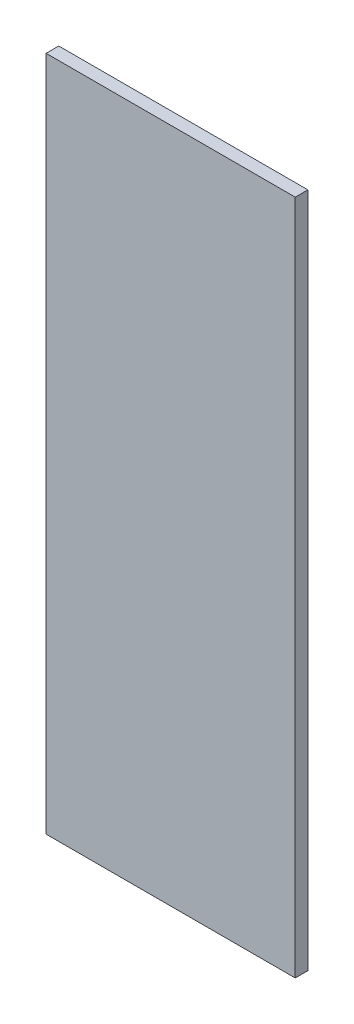
ISO-10303-21;
HEADER;
FILE_DESCRIPTION(('STEP AP214'),'2;1');
FILE_NAME('part.step','',(''),(''),'','','');
FILE_SCHEMA(('AUTOMOTIVE_DESIGN { 1 0 10303 214 1 1 1 1 }'));
ENDSEC;
DATA;
#1=APPLICATION_CONTEXT('core data for automotive mechanical design processes');
#2=APPLICATION_PROTOCOL_DEFINITION('international standard','automotive_design',2000,#1);
#3=PRODUCT_CONTEXT('',#1,'mechanical');
#4=PRODUCT('Part','Part','',(#3));
#5=PRODUCT_RELATED_PRODUCT_CATEGORY('part','',(#4));
#6=PRODUCT_DEFINITION_FORMATION('','',#4);
#7=PRODUCT_DEFINITION_CONTEXT('part definition',#1,'design');
#8=PRODUCT_DEFINITION('design','',#6,#7);
#9=PRODUCT_DEFINITION_SHAPE('','',#8);
#10=(LENGTH_UNIT() NAMED_UNIT(*) SI_UNIT(.MILLI.,.METRE.));
#11=(NAMED_UNIT(*) PLANE_ANGLE_UNIT() SI_UNIT($,.RADIAN.));
#12=(NAMED_UNIT(*) SI_UNIT($,.STERADIAN.) SOLID_ANGLE_UNIT());
#13=UNCERTAINTY_MEASURE_WITH_UNIT(LENGTH_MEASURE(1.E-05),#10,'distance_accuracy_value','');
#14=(GEOMETRIC_REPRESENTATION_CONTEXT(3) GLOBAL_UNCERTAINTY_ASSIGNED_CONTEXT((#13)) GLOBAL_UNIT_ASSIGNED_CONTEXT((#10,
#11,#12)) REPRESENTATION_CONTEXT('',''));
#15=CARTESIAN_POINT('',(0.,0.,0.));
#16=DIRECTION('',(0.,0.,1.));
#17=DIRECTION('',(1.,0.,0.));
#18=AXIS2_PLACEMENT_3D('',#15,#16,#17);
#19=CARTESIAN_POINT('',(90.4420013427734,76.5279998779297,0.));
#20=DIRECTION('',(1.,0.,0.));
#21=DIRECTION('',(0.,-1.,0.));
#22=AXIS2_PLACEMENT_3D('',#19,#20,#21);
#23=PLANE('',#22);
#24=DIRECTION('',(0.,-1.,0.));
#25=VECTOR('',#24,1.);
#26=CARTESIAN_POINT('',(90.4420013427734,76.5279998779297,0.03556));
#27=LINE('',#26,#25);
#28=CARTESIAN_POINT('',(90.4420013427734,76.5279998779297,0.03556));
#29=VERTEX_POINT('',#28);
#30=CARTESIAN_POINT('',(90.4420013427734,74.6279983520508,0.03556));
#31=VERTEX_POINT('',#30);
#32=EDGE_CURVE('E11',#29,#31,#27,.T.);
#33=ORIENTED_EDGE('',*,*,#32,.F.);
#34=DIRECTION('',(0.,0.,1.));
#35=VECTOR('',#34,1.);
#36=CARTESIAN_POINT('',(90.4420013427734,76.5279998779297,0.));
#37=LINE('',#36,#35);
#38=CARTESIAN_POINT('',(90.4420013427734,76.5279998779297,0.));
#39=VERTEX_POINT('',#38);
#40=EDGE_CURVE('E24',#39,#29,#37,.T.);
#41=ORIENTED_EDGE('',*,*,#40,.F.);
#42=DIRECTION('',(0.,-1.,0.));
#43=VECTOR('',#42,1.);
#44=CARTESIAN_POINT('',(90.4420013427734,76.5279998779297,0.));
#45=LINE('',#44,#43);
#46=CARTESIAN_POINT('',(90.4420013427734,74.6279983520508,0.));
#47=VERTEX_POINT('',#46);
#48=EDGE_CURVE('E75',#39,#47,#45,.T.);
#49=ORIENTED_EDGE('',*,*,#48,.T.);
#50=DIRECTION('',(0.,0.,1.));
#51=VECTOR('',#50,1.);
#52=CARTESIAN_POINT('',(90.4420013427734,74.6279983520508,0.));
#53=LINE('',#52,#51);
#54=EDGE_CURVE('E37',#47,#31,#53,.T.);
#55=ORIENTED_EDGE('',*,*,#54,.T.);
#56=EDGE_LOOP('',(#33,#41,#49,#55));
#57=FACE_BOUND('',#56,.T.);
#58=ADVANCED_FACE('F17',(#57),#23,.F.);
#59=CARTESIAN_POINT('',(90.4420013427734,74.6279983520508,0.));
#60=DIRECTION('',(0.,1.,0.));
#61=DIRECTION('',(1.,0.,0.));
#62=AXIS2_PLACEMENT_3D('',#59,#60,#61);
#63=PLANE('',#62);
#64=DIRECTION('',(1.,0.,0.));
#65=VECTOR('',#64,1.);
#66=CARTESIAN_POINT('',(90.4420013427734,74.6279983520508,0.03556));
#67=LINE('',#66,#65);
#68=CARTESIAN_POINT('',(91.1419982910156,74.6279983520508,0.03556));
#69=VERTEX_POINT('',#68);
#70=EDGE_CURVE('E83',#31,#69,#67,.T.);
#71=ORIENTED_EDGE('',*,*,#70,.F.);
#72=ORIENTED_EDGE('',*,*,#54,.F.);
#73=DIRECTION('',(1.,0.,0.));
#74=VECTOR('',#73,1.);
#75=CARTESIAN_POINT('',(90.4420013427734,74.6279983520508,0.));
#76=LINE('',#75,#74);
#77=CARTESIAN_POINT('',(91.1419982910156,74.6279983520508,0.));
#78=VERTEX_POINT('',#77);
#79=EDGE_CURVE('E81',#47,#78,#76,.T.);
#80=ORIENTED_EDGE('',*,*,#79,.T.);
#81=DIRECTION('',(0.,0.,1.));
#82=VECTOR('',#81,1.);
#83=CARTESIAN_POINT('',(91.1419982910156,74.6279983520508,0.));
#84=LINE('',#83,#82);
#85=EDGE_CURVE('E67',#78,#69,#84,.T.);
#86=ORIENTED_EDGE('',*,*,#85,.T.);
#87=EDGE_LOOP('',(#71,#72,#80,#86));
#88=FACE_BOUND('',#87,.T.);
#89=ADVANCED_FACE('F89',(#88),#63,.F.);
#90=CARTESIAN_POINT('',(91.1419982910156,74.6279983520508,0.));
#91=DIRECTION('',(-1.,0.,0.));
#92=DIRECTION('',(0.,1.,0.));
#93=AXIS2_PLACEMENT_3D('',#90,#91,#92);
#94=PLANE('',#93);
#95=DIRECTION('',(0.,1.,0.));
#96=VECTOR('',#95,1.);
#97=CARTESIAN_POINT('',(91.1419982910156,74.6279983520508,0.03556));
#98=LINE('',#97,#96);
#99=CARTESIAN_POINT('',(91.1419982910156,76.5279998779297,0.03556));
#100=VERTEX_POINT('',#99);
#101=EDGE_CURVE('E71',#69,#100,#98,.T.);
#102=ORIENTED_EDGE('',*,*,#101,.F.);
#103=ORIENTED_EDGE('',*,*,#85,.F.);
#104=DIRECTION('',(0.,1.,0.));
#105=VECTOR('',#104,1.);
#106=CARTESIAN_POINT('',(91.1419982910156,74.6279983520508,0.));
#107=LINE('',#106,#105);
#108=CARTESIAN_POINT('',(91.1419982910156,76.5279998779297,0.));
#109=VERTEX_POINT('',#108);
#110=EDGE_CURVE('E63',#78,#109,#107,.T.);
#111=ORIENTED_EDGE('',*,*,#110,.T.);
#112=DIRECTION('',(0.,0.,1.));
#113=VECTOR('',#112,1.);
#114=CARTESIAN_POINT('',(91.1419982910156,76.5279998779297,0.));
#115=LINE('',#114,#113);
#116=EDGE_CURVE('E53',#109,#100,#115,.T.);
#117=ORIENTED_EDGE('',*,*,#116,.T.);
#118=EDGE_LOOP('',(#102,#103,#111,#117));
#119=FACE_BOUND('',#118,.T.);
#120=ADVANCED_FACE('F66',(#119),#94,.F.);
#121=CARTESIAN_POINT('',(91.1419982910156,76.5279998779297,0.));
#122=DIRECTION('',(0.,-1.,0.));
#123=DIRECTION('',(-1.,0.,0.));
#124=AXIS2_PLACEMENT_3D('',#121,#122,#123);
#125=PLANE('',#124);
#126=DIRECTION('',(-1.,0.,0.));
#127=VECTOR('',#126,1.);
#128=CARTESIAN_POINT('',(91.1419982910156,76.5279998779297,0.03556));
#129=LINE('',#128,#127);
#130=EDGE_CURVE('E59',#100,#29,#129,.T.);
#131=ORIENTED_EDGE('',*,*,#130,.F.);
#132=ORIENTED_EDGE('',*,*,#116,.F.);
#133=DIRECTION('',(-1.,0.,0.));
#134=VECTOR('',#133,1.);
#135=CARTESIAN_POINT('',(91.1419982910156,76.5279998779297,0.));
#136=LINE('',#135,#134);
#137=EDGE_CURVE('E57',#109,#39,#136,.T.);
#138=ORIENTED_EDGE('',*,*,#137,.T.);
#139=ORIENTED_EDGE('',*,*,#40,.T.);
#140=EDGE_LOOP('',(#131,#132,#138,#139));
#141=FACE_BOUND('',#140,.T.);
#142=ADVANCED_FACE('F55',(#141),#125,.F.);
#143=CARTESIAN_POINT('',(90.4420013427734,76.5279998779297,0.));
#144=DIRECTION('',(0.,0.,-1.));
#145=DIRECTION('',(-1.,0.,0.));
#146=AXIS2_PLACEMENT_3D('',#143,#144,#145);
#147=PLANE('',#146);
#148=ORIENTED_EDGE('',*,*,#137,.F.);
#149=ORIENTED_EDGE('',*,*,#110,.F.);
#150=ORIENTED_EDGE('',*,*,#79,.F.);
#151=ORIENTED_EDGE('',*,*,#48,.F.);
#152=EDGE_LOOP('',(#148,#149,#150,#151));
#153=FACE_BOUND('',#152,.T.);
#154=ADVANCED_FACE('F74',(#153),#147,.T.);
#155=CARTESIAN_POINT('',(90.4420013427734,76.5279998779297,0.03556));
#156=DIRECTION('',(0.,0.,-1.));
#157=DIRECTION('',(-1.,0.,0.));
#158=AXIS2_PLACEMENT_3D('',#155,#156,#157);
#159=PLANE('',#158);
#160=ORIENTED_EDGE('',*,*,#32,.T.);
#161=ORIENTED_EDGE('',*,*,#70,.T.);
#162=ORIENTED_EDGE('',*,*,#101,.T.);
#163=ORIENTED_EDGE('',*,*,#130,.T.);
#164=EDGE_LOOP('',(#160,#161,#162,#163));
#165=FACE_BOUND('',#164,.T.);
#166=ADVANCED_FACE('F91',(#165),#159,.F.);
#167=CLOSED_SHELL('',(#58,#89,#120,#142,#154,#166));
#168=MANIFOLD_SOLID_BREP('B1',#167);
#169=ADVANCED_BREP_SHAPE_REPRESENTATION('',(#18,#168),#14);
#170=SHAPE_DEFINITION_REPRESENTATION(#9,#169);
ENDSEC;
END-ISO-10303-21;
